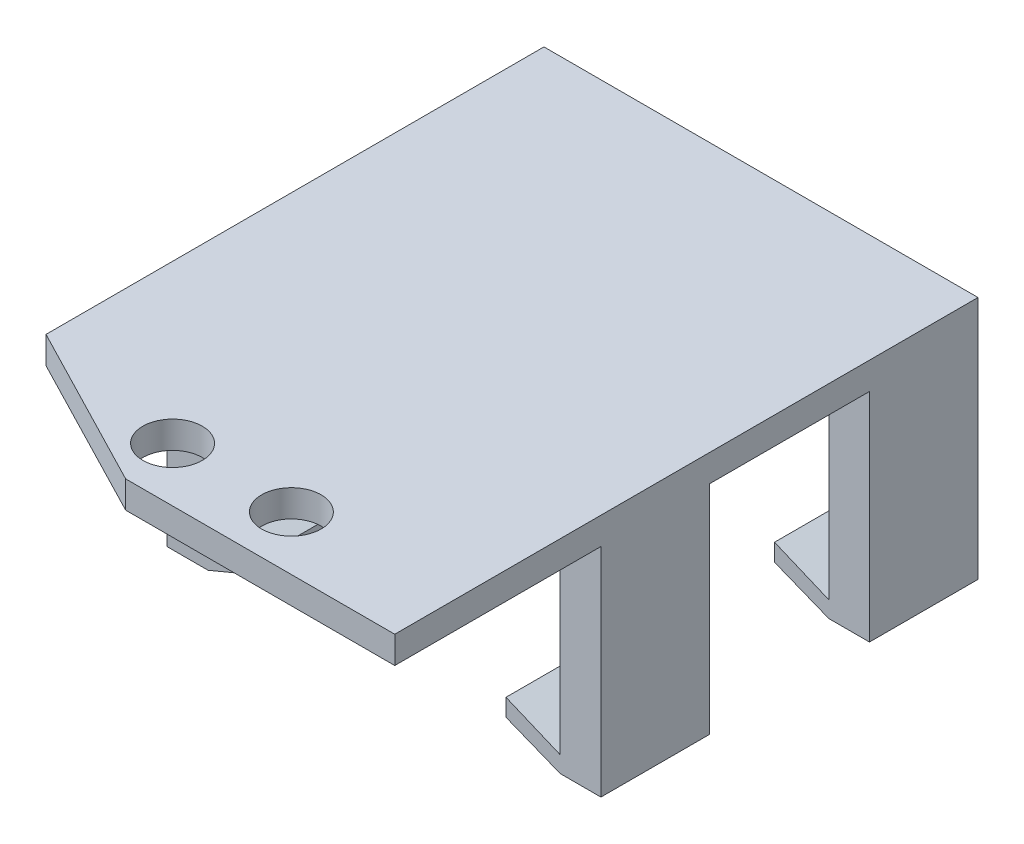
ISO-10303-21;
HEADER;
FILE_DESCRIPTION(('STEP AP214'),'2;1');
FILE_NAME('part.step','',(''),(''),'','','');
FILE_SCHEMA(('AUTOMOTIVE_DESIGN { 1 0 10303 214 1 1 1 1 }'));
ENDSEC;
DATA;
#1=APPLICATION_CONTEXT('core data for automotive mechanical design processes');
#2=APPLICATION_PROTOCOL_DEFINITION('international standard','automotive_design',2000,#1);
#3=PRODUCT_CONTEXT('',#1,'mechanical');
#4=PRODUCT('Part','Part','',(#3));
#5=PRODUCT_RELATED_PRODUCT_CATEGORY('part','',(#4));
#6=PRODUCT_DEFINITION_FORMATION('','',#4);
#7=PRODUCT_DEFINITION_CONTEXT('part definition',#1,'design');
#8=PRODUCT_DEFINITION('design','',#6,#7);
#9=PRODUCT_DEFINITION_SHAPE('','',#8);
#10=(LENGTH_UNIT() NAMED_UNIT(*) SI_UNIT(.MILLI.,.METRE.));
#11=(NAMED_UNIT(*) PLANE_ANGLE_UNIT() SI_UNIT($,.RADIAN.));
#12=(NAMED_UNIT(*) SI_UNIT($,.STERADIAN.) SOLID_ANGLE_UNIT());
#13=UNCERTAINTY_MEASURE_WITH_UNIT(LENGTH_MEASURE(1.E-05),#10,'distance_accuracy_value','');
#14=(GEOMETRIC_REPRESENTATION_CONTEXT(3) GLOBAL_UNCERTAINTY_ASSIGNED_CONTEXT((#13)) GLOBAL_UNIT_ASSIGNED_CONTEXT((#10,
#11,#12)) REPRESENTATION_CONTEXT('',''));
#15=CARTESIAN_POINT('',(0.,0.,0.));
#16=DIRECTION('',(0.,0.,1.));
#17=DIRECTION('',(1.,0.,0.));
#18=AXIS2_PLACEMENT_3D('',#15,#16,#17);
#19=CARTESIAN_POINT('',(0.,-20.32,0.));
#20=DIRECTION('',(0.,-1.,0.));
#21=DIRECTION('',(0.,0.,-1.));
#22=AXIS2_PLACEMENT_3D('',#19,#20,#21);
#23=PLANE('',#22);
#24=DIRECTION('',(1.,0.,0.));
#25=VECTOR('',#24,1.);
#26=CARTESIAN_POINT('',(-11.5172519083969,-20.32,-12.4409837837973));
#27=LINE('',#26,#25);
#28=CARTESIAN_POINT('',(-11.5172519083969,-20.32,-12.4409837837973));
#29=VERTEX_POINT('',#28);
#30=CARTESIAN_POINT('',(-7.66074574714831,-20.32,-12.4409837837973));
#31=VERTEX_POINT('',#30);
#32=EDGE_CURVE('E410',#29,#31,#27,.T.);
#33=ORIENTED_EDGE('',*,*,#32,.T.);
#34=DIRECTION('',(0.,0.,1.));
#35=VECTOR('',#34,1.);
#36=CARTESIAN_POINT('',(-7.66074574714831,-20.32,-12.4409837837973));
#37=LINE('',#36,#35);
#38=CARTESIAN_POINT('',(-7.66074574714831,-20.32,-2.28098378379731));
#39=VERTEX_POINT('',#38);
#40=EDGE_CURVE('E308',#31,#39,#37,.T.);
#41=ORIENTED_EDGE('',*,*,#40,.T.);
#42=DIRECTION('',(1.,0.,0.));
#43=VECTOR('',#42,1.);
#44=CARTESIAN_POINT('',(-11.517251908397,-20.32,-2.28098378379731));
#45=LINE('',#44,#43);
#46=CARTESIAN_POINT('',(-11.517251908397,-20.32,-2.28098378379731));
#47=VERTEX_POINT('',#46);
#48=EDGE_CURVE('E478',#47,#39,#45,.T.);
#49=ORIENTED_EDGE('',*,*,#48,.F.);
#50=DIRECTION('',(0.,0.,-1.));
#51=VECTOR('',#50,1.);
#52=CARTESIAN_POINT('',(-11.5172519083969,-20.32,27.9450162162027));
#53=LINE('',#52,#51);
#54=EDGE_CURVE('E406',#47,#29,#53,.T.);
#55=ORIENTED_EDGE('',*,*,#54,.T.);
#56=EDGE_LOOP('',(#33,#41,#49,#55));
#57=FACE_BOUND('',#56,.T.);
#58=ADVANCED_FACE('F37',(#57),#23,.T.);
#59=CARTESIAN_POINT('',(0.,-20.32,0.));
#60=DIRECTION('',(0.,1.,0.));
#61=DIRECTION('',(0.,0.,1.));
#62=AXIS2_PLACEMENT_3D('',#59,#60,#61);
#63=PLANE('',#62);
#64=DIRECTION('',(0.,0.,1.));
#65=VECTOR('',#64,1.);
#66=CARTESIAN_POINT('',(25.3127480916031,-20.32,-12.4409837837973));
#67=LINE('',#66,#65);
#68=CARTESIAN_POINT('',(25.3127480916031,-20.32,-12.4409837837973));
#69=VERTEX_POINT('',#68);
#70=CARTESIAN_POINT('',(25.3127480916031,-20.32,-2.28098378379732));
#71=VERTEX_POINT('',#70);
#72=EDGE_CURVE('E59',#69,#71,#67,.T.);
#73=ORIENTED_EDGE('',*,*,#72,.F.);
#74=DIRECTION('',(1.,0.,0.));
#75=VECTOR('',#74,1.);
#76=CARTESIAN_POINT('',(29.1227480916031,-20.32,-12.4409837837973));
#77=LINE('',#76,#75);
#78=CARTESIAN_POINT('',(29.1227480916031,-20.32,-12.4409837837973));
#79=VERTEX_POINT('',#78);
#80=EDGE_CURVE('E400',#69,#79,#77,.T.);
#81=ORIENTED_EDGE('',*,*,#80,.T.);
#82=DIRECTION('',(0.,0.,1.));
#83=VECTOR('',#82,1.);
#84=CARTESIAN_POINT('',(29.1227480916031,-20.32,27.9450162162027));
#85=LINE('',#84,#83);
#86=CARTESIAN_POINT('',(29.1227480916031,-20.32,-2.28098378379732));
#87=VERTEX_POINT('',#86);
#88=EDGE_CURVE('E403',#79,#87,#85,.T.);
#89=ORIENTED_EDGE('',*,*,#88,.T.);
#90=EDGE_CURVE('E475',#71,#87,#45,.T.);
#91=ORIENTED_EDGE('',*,*,#90,.F.);
#92=EDGE_LOOP('',(#73,#81,#89,#91));
#93=FACE_BOUND('',#92,.T.);
#94=ADVANCED_FACE('F447',(#93),#63,.F.);
#95=CARTESIAN_POINT('',(20.2327480916031,0.,0.));
#96=DIRECTION('',(-1.,0.,0.));
#97=DIRECTION('',(0.,0.,1.));
#98=AXIS2_PLACEMENT_3D('',#95,#96,#97);
#99=PLANE('',#98);
#100=DIRECTION('',(0.,-1.,0.));
#101=VECTOR('',#100,1.);
#102=CARTESIAN_POINT('',(20.2327480916031,-18.796,-12.4409837837973));
#103=LINE('',#102,#101);
#104=CARTESIAN_POINT('',(20.2327480916031,-16.6688197799885,-12.4409837837973));
#105=VERTEX_POINT('',#104);
#106=CARTESIAN_POINT('',(20.2327480916031,-18.2946026362876,-12.4409837837973));
#107=VERTEX_POINT('',#106);
#108=EDGE_CURVE('E387',#105,#107,#103,.T.);
#109=ORIENTED_EDGE('',*,*,#108,.T.);
#110=DIRECTION('',(0.,0.,1.));
#111=VECTOR('',#110,1.);
#112=CARTESIAN_POINT('',(20.2327480916031,-18.2946026362876,-12.4409837837973));
#113=LINE('',#112,#111);
#114=CARTESIAN_POINT('',(20.2327480916031,-18.2946026362876,-2.28098378379732));
#115=VERTEX_POINT('',#114);
#116=EDGE_CURVE('E560',#107,#115,#113,.T.);
#117=ORIENTED_EDGE('',*,*,#116,.T.);
#118=DIRECTION('',(0.,-1.,0.));
#119=VECTOR('',#118,1.);
#120=CARTESIAN_POINT('',(20.2327480916031,0.,-2.28098378379732));
#121=LINE('',#120,#119);
#122=CARTESIAN_POINT('',(20.2327480916031,-16.6688197799885,-2.28098378379732));
#123=VERTEX_POINT('',#122);
#124=EDGE_CURVE('E313',#123,#115,#121,.T.);
#125=ORIENTED_EDGE('',*,*,#124,.F.);
#126=DIRECTION('',(0.,0.,1.));
#127=VECTOR('',#126,1.);
#128=CARTESIAN_POINT('',(20.2327480916031,-16.6688197799885,-17.9796028196735));
#129=LINE('',#128,#127);
#130=EDGE_CURVE('E337',#105,#123,#129,.T.);
#131=ORIENTED_EDGE('',*,*,#130,.F.);
#132=EDGE_LOOP('',(#109,#117,#125,#131));
#133=FACE_BOUND('',#132,.T.);
#134=ADVANCED_FACE('F454',(#133),#99,.T.);
#135=CARTESIAN_POINT('',(-2.59340745083259,-16.6688197799885,-17.9796028196735));
#136=DIRECTION('',(0.999873452344455,-0.0159084661982284,0.));
#137=DIRECTION('',(0.0159084661982284,0.999873452344455,0.));
#138=AXIS2_PLACEMENT_3D('',#135,#136,#137);
#139=PLANE('',#138);
#140=DIRECTION('',(0.0159084661982284,0.999873452344455,0.));
#141=VECTOR('',#140,1.);
#142=CARTESIAN_POINT('',(-2.59340745083259,-16.6688197799885,-2.28098378379732));
#143=LINE('',#142,#141);
#144=CARTESIAN_POINT('',(-2.61803166417197,-18.2164923774667,-2.28098378379732));
#145=VERTEX_POINT('',#144);
#146=CARTESIAN_POINT('',(-2.59340745083259,-16.6688197799885,-2.28098378379731));
#147=VERTEX_POINT('',#146);
#148=EDGE_CURVE('E331',#145,#147,#143,.T.);
#149=ORIENTED_EDGE('',*,*,#148,.F.);
#150=DIRECTION('',(0.,0.,1.));
#151=VECTOR('',#150,1.);
#152=CARTESIAN_POINT('',(-2.61803166417197,-18.2164923774667,-12.4409837837973));
#153=LINE('',#152,#151);
#154=CARTESIAN_POINT('',(-2.61803166417197,-18.2164923774667,-12.4409837837973));
#155=VERTEX_POINT('',#154);
#156=EDGE_CURVE('E307',#155,#145,#153,.T.);
#157=ORIENTED_EDGE('',*,*,#156,.F.);
#158=DIRECTION('',(-0.0159084661982284,-0.999873452344455,0.));
#159=VECTOR('',#158,1.);
#160=CARTESIAN_POINT('',(-2.59340745083259,-16.6688197799885,-12.4409837837973));
#161=LINE('',#160,#159);
#162=CARTESIAN_POINT('',(-2.59340745083259,-16.6688197799885,-12.4409837837973));
#163=VERTEX_POINT('',#162);
#164=EDGE_CURVE('E345',#163,#155,#161,.T.);
#165=ORIENTED_EDGE('',*,*,#164,.F.);
#166=DIRECTION('',(0.,0.,1.));
#167=VECTOR('',#166,1.);
#168=CARTESIAN_POINT('',(-2.59340745083259,-16.6688197799885,-17.9796028196735));
#169=LINE('',#168,#167);
#170=EDGE_CURVE('E346',#163,#147,#169,.T.);
#171=ORIENTED_EDGE('',*,*,#170,.T.);
#172=EDGE_LOOP('',(#149,#157,#165,#171));
#173=FACE_BOUND('',#172,.T.);
#174=ADVANCED_FACE('F460',(#173),#139,.T.);
#175=DIRECTION('',(1.,0.,0.));
#176=VECTOR('',#175,1.);
#177=CARTESIAN_POINT('',(-11.517251908397,-20.32,12.7050162162027));
#178=LINE('',#177,#176);
#179=CARTESIAN_POINT('',(-11.517251908397,-20.32,12.7050162162027));
#180=VERTEX_POINT('',#179);
#181=CARTESIAN_POINT('',(-7.66074574714831,-20.32,12.7050162162027));
#182=VERTEX_POINT('',#181);
#183=EDGE_CURVE('E470',#180,#182,#178,.T.);
#184=ORIENTED_EDGE('',*,*,#183,.T.);
#185=CARTESIAN_POINT('',(-7.66074574714831,-20.32,22.8650162162027));
#186=VERTEX_POINT('',#185);
#187=EDGE_CURVE('E295',#182,#186,#37,.T.);
#188=ORIENTED_EDGE('',*,*,#187,.T.);
#189=DIRECTION('',(1.,0.,0.));
#190=VECTOR('',#189,1.);
#191=CARTESIAN_POINT('',(-11.5172519083969,-20.32,22.8650162162027));
#192=LINE('',#191,#190);
#193=CARTESIAN_POINT('',(-11.5172519083969,-20.32,22.8650162162027));
#194=VERTEX_POINT('',#193);
#195=EDGE_CURVE('E373',#194,#186,#192,.T.);
#196=ORIENTED_EDGE('',*,*,#195,.F.);
#197=EDGE_CURVE('E407',#194,#180,#53,.T.);
#198=ORIENTED_EDGE('',*,*,#197,.T.);
#199=EDGE_LOOP('',(#184,#188,#196,#198));
#200=FACE_BOUND('',#199,.T.);
#201=ADVANCED_FACE('F450',(#200),#23,.T.);
#202=CARTESIAN_POINT('',(25.3127480916031,-20.32,12.7050162162027));
#203=VERTEX_POINT('',#202);
#204=CARTESIAN_POINT('',(25.3127480916031,-20.32,22.8650162162027));
#205=VERTEX_POINT('',#204);
#206=EDGE_CURVE('E594',#203,#205,#67,.T.);
#207=ORIENTED_EDGE('',*,*,#206,.F.);
#208=CARTESIAN_POINT('',(29.1227480916031,-20.32,12.7050162162027));
#209=VERTEX_POINT('',#208);
#210=EDGE_CURVE('E476',#203,#209,#178,.T.);
#211=ORIENTED_EDGE('',*,*,#210,.T.);
#212=CARTESIAN_POINT('',(29.1227480916031,-20.32,22.8650162162027));
#213=VERTEX_POINT('',#212);
#214=EDGE_CURVE('E402',#209,#213,#85,.T.);
#215=ORIENTED_EDGE('',*,*,#214,.T.);
#216=EDGE_CURVE('E372',#205,#213,#192,.T.);
#217=ORIENTED_EDGE('',*,*,#216,.F.);
#218=EDGE_LOOP('',(#207,#211,#215,#217));
#219=FACE_BOUND('',#218,.T.);
#220=ADVANCED_FACE('F457',(#219),#63,.F.);
#221=DIRECTION('',(0.,1.,0.));
#222=VECTOR('',#221,1.);
#223=CARTESIAN_POINT('',(20.2327480916031,0.,12.7050162162027));
#224=LINE('',#223,#222);
#225=CARTESIAN_POINT('',(20.2327480916031,-18.2946026362876,12.7050162162027));
#226=VERTEX_POINT('',#225);
#227=CARTESIAN_POINT('',(20.2327480916031,-16.6688197799885,12.7050162162027));
#228=VERTEX_POINT('',#227);
#229=EDGE_CURVE('E487',#226,#228,#224,.T.);
#230=ORIENTED_EDGE('',*,*,#229,.F.);
#231=CARTESIAN_POINT('',(20.2327480916031,-18.2946026362876,22.8650162162027));
#232=VERTEX_POINT('',#231);
#233=EDGE_CURVE('E595',#226,#232,#113,.T.);
#234=ORIENTED_EDGE('',*,*,#233,.T.);
#235=DIRECTION('',(0.,1.,0.));
#236=VECTOR('',#235,1.);
#237=CARTESIAN_POINT('',(20.2327480916031,0.,22.8650162162027));
#238=LINE('',#237,#236);
#239=CARTESIAN_POINT('',(20.2327480916031,-16.6688197799885,22.8650162162027));
#240=VERTEX_POINT('',#239);
#241=EDGE_CURVE('E281',#232,#240,#238,.T.);
#242=ORIENTED_EDGE('',*,*,#241,.T.);
#243=EDGE_CURVE('E336',#228,#240,#129,.T.);
#244=ORIENTED_EDGE('',*,*,#243,.F.);
#245=EDGE_LOOP('',(#230,#234,#242,#244));
#246=FACE_BOUND('',#245,.T.);
#247=ADVANCED_FACE('F466',(#246),#99,.T.);
#248=CARTESIAN_POINT('',(-11.5172519083969,2.54,-12.4409837837973));
#249=DIRECTION('',(0.,0.,1.));
#250=DIRECTION('',(1.,0.,0.));
#251=AXIS2_PLACEMENT_3D('',#248,#249,#250);
#252=PLANE('',#251);
#253=DIRECTION('',(0.922922412237394,0.384986001031089,0.));
#254=VECTOR('',#253,1.);
#255=CARTESIAN_POINT('',(6.08451261866922,-14.5863305373994,-12.4409837837973));
#256=LINE('',#255,#254);
#257=EDGE_CURVE('E542',#31,#155,#256,.T.);
#258=ORIENTED_EDGE('',*,*,#257,.F.);
#259=ORIENTED_EDGE('',*,*,#32,.F.);
#260=DIRECTION('',(0.,-1.,0.));
#261=VECTOR('',#260,1.);
#262=CARTESIAN_POINT('',(-11.5172519083969,2.54,-12.4409837837973));
#263=LINE('',#262,#261);
#264=CARTESIAN_POINT('',(-11.5172519083969,2.54,-12.4409837837973));
#265=VERTEX_POINT('',#264);
#266=EDGE_CURVE('E266',#265,#29,#263,.T.);
#267=ORIENTED_EDGE('',*,*,#266,.F.);
#268=DIRECTION('',(-1.,0.,0.));
#269=VECTOR('',#268,1.);
#270=CARTESIAN_POINT('',(-11.5172519083969,2.54,-12.4409837837973));
#271=LINE('',#270,#269);
#272=CARTESIAN_POINT('',(29.1227480916031,2.54,-12.4409837837973));
#273=VERTEX_POINT('',#272);
#274=EDGE_CURVE('E259',#273,#265,#271,.T.);
#275=ORIENTED_EDGE('',*,*,#274,.F.);
#276=DIRECTION('',(0.,-1.,0.));
#277=VECTOR('',#276,1.);
#278=CARTESIAN_POINT('',(29.1227480916031,2.54,-12.4409837837973));
#279=LINE('',#278,#277);
#280=EDGE_CURVE('E277',#273,#79,#279,.T.);
#281=ORIENTED_EDGE('',*,*,#280,.T.);
#282=ORIENTED_EDGE('',*,*,#80,.F.);
#283=DIRECTION('',(0.928892421611158,-0.370349657855058,0.));
#284=VECTOR('',#283,1.);
#285=CARTESIAN_POINT('',(-3.51851670614279,-8.82496698546269,-12.4409837837973));
#286=LINE('',#285,#284);
#287=EDGE_CURVE('E601',#107,#69,#286,.T.);
#288=ORIENTED_EDGE('',*,*,#287,.F.);
#289=ORIENTED_EDGE('',*,*,#108,.F.);
#290=DIRECTION('',(0.922397741391246,-0.386241383950928,0.));
#291=VECTOR('',#290,1.);
#292=CARTESIAN_POINT('',(20.2327480916031,-16.6688197799885,-12.4409837837973));
#293=LINE('',#292,#291);
#294=CARTESIAN_POINT('',(25.3127480916031,-18.796,-12.4409837837973));
#295=VERTEX_POINT('',#294);
#296=EDGE_CURVE('E333',#105,#295,#293,.T.);
#297=ORIENTED_EDGE('',*,*,#296,.T.);
#298=DIRECTION('',(0.,1.,0.));
#299=VECTOR('',#298,1.);
#300=CARTESIAN_POINT('',(25.3127480916031,-20.32,-12.4409837837973));
#301=LINE('',#300,#299);
#302=CARTESIAN_POINT('',(25.3127480916031,-2.9718,-12.4409837837973));
#303=VERTEX_POINT('',#302);
#304=EDGE_CURVE('E397',#295,#303,#301,.T.);
#305=ORIENTED_EDGE('',*,*,#304,.T.);
#306=DIRECTION('',(1.,0.,0.));
#307=VECTOR('',#306,1.);
#308=CARTESIAN_POINT('',(-11.5172519083969,-2.9718,-12.4409837837973));
#309=LINE('',#308,#307);
#310=CARTESIAN_POINT('',(-7.70725190839694,-2.9718,-12.4409837837973));
#311=VERTEX_POINT('',#310);
#312=EDGE_CURVE('E356',#311,#303,#309,.T.);
#313=ORIENTED_EDGE('',*,*,#312,.F.);
#314=DIRECTION('',(0.,1.,0.));
#315=VECTOR('',#314,1.);
#316=CARTESIAN_POINT('',(-7.70725190839694,-20.32,-12.4409837837973));
#317=LINE('',#316,#315);
#318=CARTESIAN_POINT('',(-7.70725190839694,-18.796,-12.4409837837973));
#319=VERTEX_POINT('',#318);
#320=EDGE_CURVE('E413',#319,#311,#317,.T.);
#321=ORIENTED_EDGE('',*,*,#320,.F.);
#322=DIRECTION('',(0.923306770954936,0.384063284770582,0.));
#323=VECTOR('',#322,1.);
#324=CARTESIAN_POINT('',(-7.70725190839694,-18.796,-12.4409837837973));
#325=LINE('',#324,#323);
#326=EDGE_CURVE('E343',#319,#163,#325,.T.);
#327=ORIENTED_EDGE('',*,*,#326,.T.);
#328=ORIENTED_EDGE('',*,*,#164,.T.);
#329=EDGE_LOOP('',(#258,#259,#267,#275,#281,#282,#288,#289,#297,#305,#313,#321,#327,#328));
#330=FACE_BOUND('',#329,.T.);
#331=ADVANCED_FACE('F540',(#330),#252,.F.);
#332=CARTESIAN_POINT('',(0.,0.,22.8650162162027));
#333=DIRECTION('',(0.,0.,1.));
#334=DIRECTION('',(1.,0.,0.));
#335=AXIS2_PLACEMENT_3D('',#332,#333,#334);
#336=PLANE('',#335);
#337=ORIENTED_EDGE('',*,*,#195,.T.);
#338=DIRECTION('',(0.922922412237394,0.384986001031089,0.));
#339=VECTOR('',#338,1.);
#340=CARTESIAN_POINT('',(6.08451261866922,-14.5863305373994,22.8650162162027));
#341=LINE('',#340,#339);
#342=CARTESIAN_POINT('',(-2.61803166417197,-18.2164923774667,22.8650162162027));
#343=VERTEX_POINT('',#342);
#344=EDGE_CURVE('E597',#186,#343,#341,.T.);
#345=ORIENTED_EDGE('',*,*,#344,.T.);
#346=DIRECTION('',(0.0159084661982284,0.999873452344455,0.));
#347=VECTOR('',#346,1.);
#348=CARTESIAN_POINT('',(-2.59340745083259,-16.6688197799885,22.8650162162027));
#349=LINE('',#348,#347);
#350=CARTESIAN_POINT('',(-2.59340745083259,-16.6688197799885,22.8650162162027));
#351=VERTEX_POINT('',#350);
#352=EDGE_CURVE('E306',#343,#351,#349,.T.);
#353=ORIENTED_EDGE('',*,*,#352,.T.);
#354=DIRECTION('',(-0.923306770954936,-0.384063284770582,0.));
#355=VECTOR('',#354,1.);
#356=CARTESIAN_POINT('',(-7.70725190839694,-18.796,22.8650162162027));
#357=LINE('',#356,#355);
#358=CARTESIAN_POINT('',(-7.70725190839694,-18.796,22.8650162162027));
#359=VERTEX_POINT('',#358);
#360=EDGE_CURVE('E348',#351,#359,#357,.T.);
#361=ORIENTED_EDGE('',*,*,#360,.T.);
#362=DIRECTION('',(0.,1.,0.));
#363=VECTOR('',#362,1.);
#364=CARTESIAN_POINT('',(-7.70725190839694,-20.32,22.8650162162027));
#365=LINE('',#364,#363);
#366=CARTESIAN_POINT('',(-7.70725190839694,-2.9718,22.8650162162027));
#367=VERTEX_POINT('',#366);
#368=EDGE_CURVE('E383',#359,#367,#365,.T.);
#369=ORIENTED_EDGE('',*,*,#368,.T.);
#370=DIRECTION('',(-1.,0.,0.));
#371=VECTOR('',#370,1.);
#372=CARTESIAN_POINT('',(-11.5172519083969,-2.9718,22.8650162162027));
#373=LINE('',#372,#371);
#374=CARTESIAN_POINT('',(25.3127480916031,-2.9718,22.8650162162027));
#375=VERTEX_POINT('',#374);
#376=EDGE_CURVE('E359',#375,#367,#373,.T.);
#377=ORIENTED_EDGE('',*,*,#376,.F.);
#378=DIRECTION('',(0.,-1.,0.));
#379=VECTOR('',#378,1.);
#380=CARTESIAN_POINT('',(25.3127480916031,-20.32,22.8650162162027));
#381=LINE('',#380,#379);
#382=CARTESIAN_POINT('',(25.3127480916031,-18.796,22.8650162162027));
#383=VERTEX_POINT('',#382);
#384=EDGE_CURVE('E380',#375,#383,#381,.T.);
#385=ORIENTED_EDGE('',*,*,#384,.T.);
#386=DIRECTION('',(-0.922397741391246,0.386241383950928,0.));
#387=VECTOR('',#386,1.);
#388=CARTESIAN_POINT('',(20.2327480916031,-16.6688197799885,22.8650162162027));
#389=LINE('',#388,#387);
#390=EDGE_CURVE('E340',#383,#240,#389,.T.);
#391=ORIENTED_EDGE('',*,*,#390,.T.);
#392=ORIENTED_EDGE('',*,*,#241,.F.);
#393=DIRECTION('',(0.928892421611158,-0.370349657855058,0.));
#394=VECTOR('',#393,1.);
#395=CARTESIAN_POINT('',(-3.51851670614279,-8.82496698546269,22.8650162162027));
#396=LINE('',#395,#394);
#397=EDGE_CURVE('E598',#232,#205,#396,.T.);
#398=ORIENTED_EDGE('',*,*,#397,.T.);
#399=ORIENTED_EDGE('',*,*,#216,.T.);
#400=DIRECTION('',(0.,1.,0.));
#401=VECTOR('',#400,1.);
#402=CARTESIAN_POINT('',(29.1227480916031,0.,22.8650162162027));
#403=LINE('',#402,#401);
#404=CARTESIAN_POINT('',(29.1227480916031,0.,22.8650162162027));
#405=VERTEX_POINT('',#404);
#406=EDGE_CURVE('E376',#213,#405,#403,.T.);
#407=ORIENTED_EDGE('',*,*,#406,.T.);
#408=DIRECTION('',(-1.,0.,0.));
#409=VECTOR('',#408,1.);
#410=CARTESIAN_POINT('',(-11.5172519083969,0.,22.8650162162027));
#411=LINE('',#410,#409);
#412=CARTESIAN_POINT('',(-11.5172519083969,0.,22.8650162162027));
#413=VERTEX_POINT('',#412);
#414=EDGE_CURVE('E378',#405,#413,#411,.T.);
#415=ORIENTED_EDGE('',*,*,#414,.T.);
#416=DIRECTION('',(0.,-1.,0.));
#417=VECTOR('',#416,1.);
#418=CARTESIAN_POINT('',(-11.5172519083969,0.,22.8650162162027));
#419=LINE('',#418,#417);
#420=EDGE_CURVE('E370',#413,#194,#419,.T.);
#421=ORIENTED_EDGE('',*,*,#420,.T.);
#422=EDGE_LOOP('',(#337,#345,#353,#361,#369,#377,#385,#391,#392,#398,#399,#407,#415,#421));
#423=FACE_BOUND('',#422,.T.);
#424=ADVANCED_FACE('F504',(#423),#336,.T.);
#425=ORIENTED_EDGE('',*,*,#352,.F.);
#426=CARTESIAN_POINT('',(-2.61803166417197,-18.2164923774667,12.7050162162027));
#427=VERTEX_POINT('',#426);
#428=EDGE_CURVE('E292',#427,#343,#153,.T.);
#429=ORIENTED_EDGE('',*,*,#428,.F.);
#430=DIRECTION('',(-0.0159084661982284,-0.999873452344455,0.));
#431=VECTOR('',#430,1.);
#432=CARTESIAN_POINT('',(-2.59340745083259,-16.6688197799885,12.7050162162027));
#433=LINE('',#432,#431);
#434=CARTESIAN_POINT('',(-2.59340745083259,-16.6688197799885,12.7050162162027));
#435=VERTEX_POINT('',#434);
#436=EDGE_CURVE('E304',#435,#427,#433,.T.);
#437=ORIENTED_EDGE('',*,*,#436,.F.);
#438=EDGE_CURVE('E351',#435,#351,#169,.T.);
#439=ORIENTED_EDGE('',*,*,#438,.T.);
#440=EDGE_LOOP('',(#425,#429,#437,#439));
#441=FACE_BOUND('',#440,.T.);
#442=ADVANCED_FACE('F302',(#441),#139,.T.);
#443=CARTESIAN_POINT('',(-11.517251908397,-20.32,-2.28098378379731));
#444=DIRECTION('',(0.,0.,-1.));
#445=DIRECTION('',(-1.,0.,0.));
#446=AXIS2_PLACEMENT_3D('',#443,#444,#445);
#447=PLANE('',#446);
#448=DIRECTION('',(-0.922922412237394,-0.384986001031089,0.));
#449=VECTOR('',#448,1.);
#450=CARTESIAN_POINT('',(-10.9456628519647,-21.6902637222083,-2.28098378379731));
#451=LINE('',#450,#449);
#452=EDGE_CURVE('E565',#145,#39,#451,.T.);
#453=ORIENTED_EDGE('',*,*,#452,.F.);
#454=ORIENTED_EDGE('',*,*,#148,.T.);
#455=DIRECTION('',(-0.923306770954936,-0.384063284770582,0.));
#456=VECTOR('',#455,1.);
#457=CARTESIAN_POINT('',(-7.70725190839694,-18.796,-2.28098378379731));
#458=LINE('',#457,#456);
#459=CARTESIAN_POINT('',(-7.70725190839694,-18.796,-2.28098378379731));
#460=VERTEX_POINT('',#459);
#461=EDGE_CURVE('E329',#147,#460,#458,.T.);
#462=ORIENTED_EDGE('',*,*,#461,.T.);
#463=DIRECTION('',(0.,-1.,0.));
#464=VECTOR('',#463,1.);
#465=CARTESIAN_POINT('',(-7.70725190839694,-20.32,-2.28098378379731));
#466=LINE('',#465,#464);
#467=CARTESIAN_POINT('',(-7.70725190839694,-2.9718,-2.28098378379732));
#468=VERTEX_POINT('',#467);
#469=EDGE_CURVE('E326',#468,#460,#466,.T.);
#470=ORIENTED_EDGE('',*,*,#469,.F.);
#471=DIRECTION('',(1.,0.,0.));
#472=VECTOR('',#471,1.);
#473=CARTESIAN_POINT('',(0.,-2.9718,-2.28098378379732));
#474=LINE('',#473,#472);
#475=CARTESIAN_POINT('',(25.3127480916031,-2.9718,-2.28098378379732));
#476=VERTEX_POINT('',#475);
#477=EDGE_CURVE('E324',#468,#476,#474,.T.);
#478=ORIENTED_EDGE('',*,*,#477,.T.);
#479=DIRECTION('',(0.,1.,0.));
#480=VECTOR('',#479,1.);
#481=CARTESIAN_POINT('',(25.3127480916031,-20.32,-2.28098378379732));
#482=LINE('',#481,#480);
#483=CARTESIAN_POINT('',(25.3127480916031,-18.796,-2.28098378379732));
#484=VERTEX_POINT('',#483);
#485=EDGE_CURVE('E316',#484,#476,#482,.T.);
#486=ORIENTED_EDGE('',*,*,#485,.F.);
#487=DIRECTION('',(-0.922397741391246,0.386241383950928,0.));
#488=VECTOR('',#487,1.);
#489=CARTESIAN_POINT('',(20.2327480916031,-16.6688197799885,-2.28098378379732));
#490=LINE('',#489,#488);
#491=EDGE_CURVE('E285',#484,#123,#490,.T.);
#492=ORIENTED_EDGE('',*,*,#491,.T.);
#493=ORIENTED_EDGE('',*,*,#124,.T.);
#494=DIRECTION('',(-0.928892421611158,0.370349657855058,0.));
#495=VECTOR('',#494,1.);
#496=CARTESIAN_POINT('',(-6.46569076042514,-7.64992789885931,-2.28098378379732));
#497=LINE('',#496,#495);
#498=EDGE_CURVE('E561',#71,#115,#497,.T.);
#499=ORIENTED_EDGE('',*,*,#498,.F.);
#500=ORIENTED_EDGE('',*,*,#90,.T.);
#501=DIRECTION('',(0.,1.,0.));
#502=VECTOR('',#501,1.);
#503=CARTESIAN_POINT('',(29.1227480916031,-20.32,-2.28098378379732));
#504=LINE('',#503,#502);
#505=CARTESIAN_POINT('',(29.1227480916031,0.,-2.28098378379732));
#506=VERTEX_POINT('',#505);
#507=EDGE_CURVE('E572',#87,#506,#504,.T.);
#508=ORIENTED_EDGE('',*,*,#507,.T.);
#509=DIRECTION('',(1.,0.,0.));
#510=VECTOR('',#509,1.);
#511=CARTESIAN_POINT('',(-11.517251908397,0.,-2.28098378379732));
#512=LINE('',#511,#510);
#513=CARTESIAN_POINT('',(-11.517251908397,0.,-2.28098378379732));
#514=VERTEX_POINT('',#513);
#515=EDGE_CURVE('E484',#514,#506,#512,.T.);
#516=ORIENTED_EDGE('',*,*,#515,.F.);
#517=DIRECTION('',(0.,1.,0.));
#518=VECTOR('',#517,1.);
#519=CARTESIAN_POINT('',(-11.517251908397,-20.32,-2.28098378379731));
#520=LINE('',#519,#518);
#521=EDGE_CURVE('E583',#47,#514,#520,.T.);
#522=ORIENTED_EDGE('',*,*,#521,.F.);
#523=ORIENTED_EDGE('',*,*,#48,.T.);
#524=EDGE_LOOP('',(#453,#454,#462,#470,#478,#486,#492,#493,#499,#500,#508,#516,#522,#523));
#525=FACE_BOUND('',#524,.T.);
#526=ADVANCED_FACE('F548',(#525),#447,.F.);
#527=CARTESIAN_POINT('',(-11.517251908397,-20.32,12.7050162162027));
#528=DIRECTION('',(0.,0.,1.));
#529=DIRECTION('',(0.,-1.,0.));
#530=AXIS2_PLACEMENT_3D('',#527,#528,#529);
#531=PLANE('',#530);
#532=DIRECTION('',(0.922922412237394,0.384986001031089,0.));
#533=VECTOR('',#532,1.);
#534=CARTESIAN_POINT('',(-10.9456628519647,-21.6902637222083,12.7050162162027));
#535=LINE('',#534,#533);
#536=EDGE_CURVE('E45',#182,#427,#535,.T.);
#537=ORIENTED_EDGE('',*,*,#536,.F.);
#538=ORIENTED_EDGE('',*,*,#183,.F.);
#539=DIRECTION('',(0.,-1.,0.));
#540=VECTOR('',#539,1.);
#541=CARTESIAN_POINT('',(-11.517251908397,-20.32,12.7050162162027));
#542=LINE('',#541,#540);
#543=CARTESIAN_POINT('',(-11.517251908397,0.,12.7050162162027));
#544=VERTEX_POINT('',#543);
#545=EDGE_CURVE('E486',#544,#180,#542,.T.);
#546=ORIENTED_EDGE('',*,*,#545,.F.);
#547=DIRECTION('',(1.,0.,0.));
#548=VECTOR('',#547,1.);
#549=CARTESIAN_POINT('',(-11.517251908397,0.,12.7050162162027));
#550=LINE('',#549,#548);
#551=CARTESIAN_POINT('',(29.1227480916031,0.,12.7050162162027));
#552=VERTEX_POINT('',#551);
#553=EDGE_CURVE('E480',#544,#552,#550,.T.);
#554=ORIENTED_EDGE('',*,*,#553,.T.);
#555=DIRECTION('',(0.,-1.,0.));
#556=VECTOR('',#555,1.);
#557=CARTESIAN_POINT('',(29.1227480916031,-20.32,12.7050162162027));
#558=LINE('',#557,#556);
#559=EDGE_CURVE('E577',#552,#209,#558,.T.);
#560=ORIENTED_EDGE('',*,*,#559,.T.);
#561=ORIENTED_EDGE('',*,*,#210,.F.);
#562=DIRECTION('',(0.928892421611158,-0.370349657855058,0.));
#563=VECTOR('',#562,1.);
#564=CARTESIAN_POINT('',(-6.46569076042514,-7.64992789885931,12.7050162162027));
#565=LINE('',#564,#563);
#566=EDGE_CURVE('E287',#226,#203,#565,.T.);
#567=ORIENTED_EDGE('',*,*,#566,.F.);
#568=ORIENTED_EDGE('',*,*,#229,.T.);
#569=DIRECTION('',(0.922397741391246,-0.386241383950928,0.));
#570=VECTOR('',#569,1.);
#571=CARTESIAN_POINT('',(20.2327480916031,-16.6688197799885,12.7050162162027));
#572=LINE('',#571,#570);
#573=CARTESIAN_POINT('',(25.3127480916031,-18.796,12.7050162162027));
#574=VERTEX_POINT('',#573);
#575=EDGE_CURVE('E283',#228,#574,#572,.T.);
#576=ORIENTED_EDGE('',*,*,#575,.T.);
#577=DIRECTION('',(0.,-1.,0.));
#578=VECTOR('',#577,1.);
#579=CARTESIAN_POINT('',(25.3127480916031,-20.32,12.7050162162027));
#580=LINE('',#579,#578);
#581=CARTESIAN_POINT('',(25.3127480916031,-2.9718,12.7050162162027));
#582=VERTEX_POINT('',#581);
#583=EDGE_CURVE('E489',#582,#574,#580,.T.);
#584=ORIENTED_EDGE('',*,*,#583,.F.);
#585=DIRECTION('',(-1.,0.,0.));
#586=VECTOR('',#585,1.);
#587=CARTESIAN_POINT('',(0.,-2.9718,12.7050162162027));
#588=LINE('',#587,#586);
#589=CARTESIAN_POINT('',(-7.70725190839694,-2.9718,12.7050162162027));
#590=VERTEX_POINT('',#589);
#591=EDGE_CURVE('E492',#582,#590,#588,.T.);
#592=ORIENTED_EDGE('',*,*,#591,.T.);
#593=DIRECTION('',(0.,1.,0.));
#594=VECTOR('',#593,1.);
#595=CARTESIAN_POINT('',(-7.70725190839694,-20.32,12.7050162162027));
#596=LINE('',#595,#594);
#597=CARTESIAN_POINT('',(-7.70725190839694,-18.796,12.7050162162027));
#598=VERTEX_POINT('',#597);
#599=EDGE_CURVE('E318',#598,#590,#596,.T.);
#600=ORIENTED_EDGE('',*,*,#599,.F.);
#601=DIRECTION('',(0.923306770954936,0.384063284770582,0.));
#602=VECTOR('',#601,1.);
#603=CARTESIAN_POINT('',(-7.70725190839694,-18.796,12.7050162162027));
#604=LINE('',#603,#602);
#605=EDGE_CURVE('E312',#598,#435,#604,.T.);
#606=ORIENTED_EDGE('',*,*,#605,.T.);
#607=ORIENTED_EDGE('',*,*,#436,.T.);
#608=EDGE_LOOP('',(#537,#538,#546,#554,#560,#561,#567,#568,#576,#584,#592,#600,#606,#607));
#609=FACE_BOUND('',#608,.T.);
#610=ADVANCED_FACE('F310',(#609),#531,.F.);
#611=CARTESIAN_POINT('',(25.3127480916031,-20.32,27.9450162162027));
#612=DIRECTION('',(1.,0.,0.));
#613=DIRECTION('',(0.,0.,-1.));
#614=AXIS2_PLACEMENT_3D('',#611,#612,#613);
#615=PLANE('',#614);
#616=DIRECTION('',(0.,0.,-1.));
#617=VECTOR('',#616,1.);
#618=CARTESIAN_POINT('',(25.3127480916031,-18.796,-12.4409837837973));
#619=LINE('',#618,#617);
#620=EDGE_CURVE('E386',#484,#295,#619,.T.);
#621=ORIENTED_EDGE('',*,*,#620,.F.);
#622=ORIENTED_EDGE('',*,*,#485,.T.);
#623=DIRECTION('',(0.,0.,-1.));
#624=VECTOR('',#623,1.);
#625=CARTESIAN_POINT('',(25.3127480916031,-2.9718,27.9450162162027));
#626=LINE('',#625,#624);
#627=EDGE_CURVE('E366',#476,#303,#626,.T.);
#628=ORIENTED_EDGE('',*,*,#627,.T.);
#629=ORIENTED_EDGE('',*,*,#304,.F.);
#630=EDGE_LOOP('',(#621,#622,#628,#629));
#631=FACE_BOUND('',#630,.T.);
#632=ADVANCED_FACE('F553',(#631),#615,.F.);
#633=CARTESIAN_POINT('',(-7.70725190839694,-20.32,27.9450162162027));
#634=DIRECTION('',(-1.,0.,0.));
#635=DIRECTION('',(0.,0.,1.));
#636=AXIS2_PLACEMENT_3D('',#633,#634,#635);
#637=PLANE('',#636);
#638=DIRECTION('',(0.,0.,1.));
#639=VECTOR('',#638,1.);
#640=CARTESIAN_POINT('',(-7.70725190839694,-2.9718,27.9450162162027));
#641=LINE('',#640,#639);
#642=EDGE_CURVE('E363',#311,#468,#641,.T.);
#643=ORIENTED_EDGE('',*,*,#642,.T.);
#644=ORIENTED_EDGE('',*,*,#469,.T.);
#645=DIRECTION('',(0.,0.,1.));
#646=VECTOR('',#645,1.);
#647=CARTESIAN_POINT('',(-7.70725190839694,-18.796,27.9450162162027));
#648=LINE('',#647,#646);
#649=EDGE_CURVE('E394',#319,#460,#648,.T.);
#650=ORIENTED_EDGE('',*,*,#649,.F.);
#651=ORIENTED_EDGE('',*,*,#320,.T.);
#652=EDGE_LOOP('',(#643,#644,#650,#651));
#653=FACE_BOUND('',#652,.T.);
#654=ADVANCED_FACE('F529',(#653),#637,.F.);
#655=CARTESIAN_POINT('',(0.,-2.9718,0.));
#656=DIRECTION('',(0.,-1.,0.));
#657=DIRECTION('',(0.,0.,-1.));
#658=AXIS2_PLACEMENT_3D('',#655,#656,#657);
#659=PLANE('',#658);
#660=ORIENTED_EDGE('',*,*,#477,.F.);
#661=ORIENTED_EDGE('',*,*,#642,.F.);
#662=ORIENTED_EDGE('',*,*,#312,.T.);
#663=ORIENTED_EDGE('',*,*,#627,.F.);
#664=EDGE_LOOP('',(#660,#661,#662,#663));
#665=FACE_BOUND('',#664,.T.);
#666=ADVANCED_FACE('F521',(#665),#659,.T.);
#667=CARTESIAN_POINT('',(-7.70725190839694,-18.796,-17.9796028196735));
#668=DIRECTION('',(-0.384063284770582,0.923306770954936,0.));
#669=DIRECTION('',(-0.923306770954936,-0.384063284770582,0.));
#670=AXIS2_PLACEMENT_3D('',#667,#668,#669);
#671=PLANE('',#670);
#672=ORIENTED_EDGE('',*,*,#461,.F.);
#673=ORIENTED_EDGE('',*,*,#170,.F.);
#674=ORIENTED_EDGE('',*,*,#326,.F.);
#675=ORIENTED_EDGE('',*,*,#649,.T.);
#676=EDGE_LOOP('',(#672,#673,#674,#675));
#677=FACE_BOUND('',#676,.T.);
#678=ADVANCED_FACE('F511',(#677),#671,.T.);
#679=CARTESIAN_POINT('',(20.2327480916031,-16.6688197799885,-17.9796028196735));
#680=DIRECTION('',(0.386241383950928,0.922397741391246,0.));
#681=DIRECTION('',(-0.922397741391246,0.386241383950928,0.));
#682=AXIS2_PLACEMENT_3D('',#679,#680,#681);
#683=PLANE('',#682);
#684=ORIENTED_EDGE('',*,*,#491,.F.);
#685=ORIENTED_EDGE('',*,*,#620,.T.);
#686=ORIENTED_EDGE('',*,*,#296,.F.);
#687=ORIENTED_EDGE('',*,*,#130,.T.);
#688=EDGE_LOOP('',(#684,#685,#686,#687));
#689=FACE_BOUND('',#688,.T.);
#690=ADVANCED_FACE('F519',(#689),#683,.T.);
#691=CARTESIAN_POINT('',(0.,0.,0.));
#692=DIRECTION('',(0.,1.,0.));
#693=DIRECTION('',(0.,0.,1.));
#694=AXIS2_PLACEMENT_3D('',#691,#692,#693);
#695=PLANE('',#694);
#696=DIRECTION('',(1.,0.,0.));
#697=VECTOR('',#696,1.);
#698=CARTESIAN_POINT('',(18.8852561135843,0.,42.1690162162027));
#699=LINE('',#698,#697);
#700=CARTESIAN_POINT('',(3.92724006962182,0.,42.1690162162027));
#701=VERTEX_POINT('',#700);
#702=CARTESIAN_POINT('',(29.1227480916031,0.,42.1690162162027));
#703=VERTEX_POINT('',#702);
#704=EDGE_CURVE('E270',#701,#703,#699,.T.);
#705=ORIENTED_EDGE('',*,*,#704,.F.);
#706=DIRECTION('',(-0.888278607187186,0.,-0.459305035911423));
#707=VECTOR('',#706,1.);
#708=CARTESIAN_POINT('',(-16.3760772977566,0.,31.6707155286802));
#709=LINE('',#708,#707);
#710=CARTESIAN_POINT('',(-11.5172519083969,0.,34.1830837787881));
#711=VERTEX_POINT('',#710);
#712=EDGE_CURVE('E52',#701,#711,#709,.T.);
#713=ORIENTED_EDGE('',*,*,#712,.T.);
#714=DIRECTION('',(0.,0.,1.));
#715=VECTOR('',#714,1.);
#716=CARTESIAN_POINT('',(-11.5172519083969,0.,-12.4409837837973));
#717=LINE('',#716,#715);
#718=EDGE_CURVE('E267',#413,#711,#717,.T.);
#719=ORIENTED_EDGE('',*,*,#718,.F.);
#720=ORIENTED_EDGE('',*,*,#414,.F.);
#721=DIRECTION('',(0.,0.,-1.));
#722=VECTOR('',#721,1.);
#723=CARTESIAN_POINT('',(29.1227480916031,0.,-12.4409837837973));
#724=LINE('',#723,#722);
#725=EDGE_CURVE('E261',#703,#405,#724,.T.);
#726=ORIENTED_EDGE('',*,*,#725,.F.);
#727=EDGE_LOOP('',(#705,#713,#719,#720,#726));
#728=FACE_BOUND('',#727,.T.);
#729=CARTESIAN_POINT('',(3.24014809160307,0.,37.0890162162027));
#730=DIRECTION('',(0.,1.,0.));
#731=DIRECTION('',(0.,0.,1.));
#732=AXIS2_PLACEMENT_3D('',#729,#730,#731);
#733=CIRCLE('',#732,2.7813);
#734=CARTESIAN_POINT('',(3.24014809160307,0.,39.8703162162027));
#735=VERTEX_POINT('',#734);
#736=EDGE_CURVE('E420',#735,#735,#733,.T.);
#737=ORIENTED_EDGE('',*,*,#736,.T.);
#738=EDGE_LOOP('',(#737));
#739=FACE_BOUND('',#738,.T.);
#740=CARTESIAN_POINT('',(14.3653480916031,0.,37.0890162162027));
#741=DIRECTION('',(0.,1.,0.));
#742=DIRECTION('',(0.,0.,1.));
#743=AXIS2_PLACEMENT_3D('',#740,#741,#742);
#744=CIRCLE('',#743,2.7813);
#745=CARTESIAN_POINT('',(14.3653480916031,0.,39.8703162162027));
#746=VERTEX_POINT('',#745);
#747=EDGE_CURVE('E416',#746,#746,#744,.T.);
#748=ORIENTED_EDGE('',*,*,#747,.T.);
#749=EDGE_LOOP('',(#748));
#750=FACE_BOUND('',#749,.T.);
#751=ADVANCED_FACE('F427',(#728,#739,#750),#695,.F.);
#752=EDGE_CURVE('E367',#375,#582,#626,.T.);
#753=ORIENTED_EDGE('',*,*,#752,.T.);
#754=ORIENTED_EDGE('',*,*,#583,.T.);
#755=EDGE_CURVE('E391',#383,#574,#619,.T.);
#756=ORIENTED_EDGE('',*,*,#755,.F.);
#757=ORIENTED_EDGE('',*,*,#384,.F.);
#758=EDGE_LOOP('',(#753,#754,#756,#757));
#759=FACE_BOUND('',#758,.T.);
#760=ADVANCED_FACE('F633',(#759),#615,.F.);
#761=EDGE_CURVE('E390',#598,#359,#648,.T.);
#762=ORIENTED_EDGE('',*,*,#761,.F.);
#763=ORIENTED_EDGE('',*,*,#599,.T.);
#764=EDGE_CURVE('E362',#590,#367,#641,.T.);
#765=ORIENTED_EDGE('',*,*,#764,.T.);
#766=ORIENTED_EDGE('',*,*,#368,.F.);
#767=EDGE_LOOP('',(#762,#763,#765,#766));
#768=FACE_BOUND('',#767,.T.);
#769=ADVANCED_FACE('F497',(#768),#637,.F.);
#770=CARTESIAN_POINT('',(0.,2.54,0.));
#771=DIRECTION('',(0.,1.,0.));
#772=DIRECTION('',(0.,0.,1.));
#773=AXIS2_PLACEMENT_3D('',#770,#771,#772);
#774=PLANE('',#773);
#775=DIRECTION('',(-0.888278607187186,0.,-0.459305035911423));
#776=VECTOR('',#775,1.);
#777=CARTESIAN_POINT('',(-16.3760772977566,2.54,31.6707155286802));
#778=LINE('',#777,#776);
#779=CARTESIAN_POINT('',(3.92724006962185,2.54,42.1690162162027));
#780=VERTEX_POINT('',#779);
#781=CARTESIAN_POINT('',(-11.5172519083969,2.54,34.1830837787881));
#782=VERTEX_POINT('',#781);
#783=EDGE_CURVE('E238',#780,#782,#778,.T.);
#784=ORIENTED_EDGE('',*,*,#783,.F.);
#785=DIRECTION('',(1.,0.,0.));
#786=VECTOR('',#785,1.);
#787=CARTESIAN_POINT('',(-11.5172519083969,2.54,42.1690162162027));
#788=LINE('',#787,#786);
#789=CARTESIAN_POINT('',(29.1227480916031,2.54,42.1690162162027));
#790=VERTEX_POINT('',#789);
#791=EDGE_CURVE('E247',#780,#790,#788,.T.);
#792=ORIENTED_EDGE('',*,*,#791,.T.);
#793=DIRECTION('',(0.,0.,-1.));
#794=VECTOR('',#793,1.);
#795=CARTESIAN_POINT('',(29.1227480916031,2.54,42.1690162162027));
#796=LINE('',#795,#794);
#797=EDGE_CURVE('E257',#790,#273,#796,.T.);
#798=ORIENTED_EDGE('',*,*,#797,.T.);
#799=ORIENTED_EDGE('',*,*,#274,.T.);
#800=DIRECTION('',(0.,0.,1.));
#801=VECTOR('',#800,1.);
#802=CARTESIAN_POINT('',(-11.5172519083969,2.54,-12.4409837837973));
#803=LINE('',#802,#801);
#804=EDGE_CURVE('E250',#265,#782,#803,.T.);
#805=ORIENTED_EDGE('',*,*,#804,.T.);
#806=EDGE_LOOP('',(#784,#792,#798,#799,#805));
#807=FACE_BOUND('',#806,.T.);
#808=CARTESIAN_POINT('',(3.24014809160307,2.54,37.0890162162027));
#809=DIRECTION('',(0.,1.,0.));
#810=DIRECTION('',(0.,0.,1.));
#811=AXIS2_PLACEMENT_3D('',#808,#809,#810);
#812=CIRCLE('',#811,2.7813);
#813=CARTESIAN_POINT('',(3.24014809160307,2.54,39.8703162162027));
#814=VERTEX_POINT('',#813);
#815=EDGE_CURVE('E271',#814,#814,#812,.T.);
#816=ORIENTED_EDGE('',*,*,#815,.F.);
#817=EDGE_LOOP('',(#816));
#818=FACE_BOUND('',#817,.T.);
#819=CARTESIAN_POINT('',(14.3653480916031,2.54,37.0890162162027));
#820=DIRECTION('',(0.,1.,0.));
#821=DIRECTION('',(0.,0.,1.));
#822=AXIS2_PLACEMENT_3D('',#819,#820,#821);
#823=CIRCLE('',#822,2.7813);
#824=CARTESIAN_POINT('',(14.3653480916031,2.54,39.8703162162027));
#825=VERTEX_POINT('',#824);
#826=EDGE_CURVE('E417',#825,#825,#823,.T.);
#827=ORIENTED_EDGE('',*,*,#826,.F.);
#828=EDGE_LOOP('',(#827));
#829=FACE_BOUND('',#828,.T.);
#830=ADVANCED_FACE('F245',(#807,#818,#829),#774,.T.);
#831=CARTESIAN_POINT('',(-11.5172519083969,2.54,-12.4409837837973));
#832=DIRECTION('',(1.,0.,0.));
#833=DIRECTION('',(0.,0.,-1.));
#834=AXIS2_PLACEMENT_3D('',#831,#832,#833);
#835=PLANE('',#834);
#836=ORIENTED_EDGE('',*,*,#718,.T.);
#837=DIRECTION('',(0.,1.,0.));
#838=VECTOR('',#837,1.);
#839=CARTESIAN_POINT('',(-11.5172519083969,-20.32,34.1830837787881));
#840=LINE('',#839,#838);
#841=EDGE_CURVE('E251',#711,#782,#840,.T.);
#842=ORIENTED_EDGE('',*,*,#841,.T.);
#843=ORIENTED_EDGE('',*,*,#804,.F.);
#844=ORIENTED_EDGE('',*,*,#266,.T.);
#845=ORIENTED_EDGE('',*,*,#54,.F.);
#846=ORIENTED_EDGE('',*,*,#521,.T.);
#847=DIRECTION('',(0.,0.,1.));
#848=VECTOR('',#847,1.);
#849=CARTESIAN_POINT('',(-11.517251908397,0.,-2.28098378379732));
#850=LINE('',#849,#848);
#851=EDGE_CURVE('E587',#514,#544,#850,.T.);
#852=ORIENTED_EDGE('',*,*,#851,.T.);
#853=ORIENTED_EDGE('',*,*,#545,.T.);
#854=ORIENTED_EDGE('',*,*,#197,.F.);
#855=ORIENTED_EDGE('',*,*,#420,.F.);
#856=EDGE_LOOP('',(#836,#842,#843,#844,#845,#846,#852,#853,#854,#855));
#857=FACE_BOUND('',#856,.T.);
#858=ADVANCED_FACE('F39',(#857),#835,.F.);
#859=CARTESIAN_POINT('',(18.8852561135843,2.54,42.1690162162027));
#860=DIRECTION('',(0.,0.,-1.));
#861=DIRECTION('',(-1.,0.,0.));
#862=AXIS2_PLACEMENT_3D('',#859,#860,#861);
#863=PLANE('',#862);
#864=ORIENTED_EDGE('',*,*,#791,.F.);
#865=DIRECTION('',(0.,-1.,0.));
#866=VECTOR('',#865,1.);
#867=CARTESIAN_POINT('',(3.92724006962182,2.54,42.1690162162027));
#868=LINE('',#867,#866);
#869=EDGE_CURVE('E11',#780,#701,#868,.T.);
#870=ORIENTED_EDGE('',*,*,#869,.T.);
#871=ORIENTED_EDGE('',*,*,#704,.T.);
#872=DIRECTION('',(0.,-1.,0.));
#873=VECTOR('',#872,1.);
#874=CARTESIAN_POINT('',(29.1227480916031,2.54,42.1690162162027));
#875=LINE('',#874,#873);
#876=EDGE_CURVE('E255',#790,#703,#875,.T.);
#877=ORIENTED_EDGE('',*,*,#876,.F.);
#878=EDGE_LOOP('',(#864,#870,#871,#877));
#879=FACE_BOUND('',#878,.T.);
#880=ADVANCED_FACE('F253',(#879),#863,.F.);
#881=CARTESIAN_POINT('',(29.1227480916031,2.54,-12.4409837837973));
#882=DIRECTION('',(-1.,0.,0.));
#883=DIRECTION('',(0.,0.,1.));
#884=AXIS2_PLACEMENT_3D('',#881,#882,#883);
#885=PLANE('',#884);
#886=DIRECTION('',(0.,0.,1.));
#887=VECTOR('',#886,1.);
#888=CARTESIAN_POINT('',(29.1227480916031,0.,-2.28098378379732));
#889=LINE('',#888,#887);
#890=EDGE_CURVE('E575',#506,#552,#889,.T.);
#891=ORIENTED_EDGE('',*,*,#890,.F.);
#892=ORIENTED_EDGE('',*,*,#507,.F.);
#893=ORIENTED_EDGE('',*,*,#88,.F.);
#894=ORIENTED_EDGE('',*,*,#280,.F.);
#895=ORIENTED_EDGE('',*,*,#797,.F.);
#896=ORIENTED_EDGE('',*,*,#876,.T.);
#897=ORIENTED_EDGE('',*,*,#725,.T.);
#898=ORIENTED_EDGE('',*,*,#406,.F.);
#899=ORIENTED_EDGE('',*,*,#214,.F.);
#900=ORIENTED_EDGE('',*,*,#559,.F.);
#901=EDGE_LOOP('',(#891,#892,#893,#894,#895,#896,#897,#898,#899,#900));
#902=FACE_BOUND('',#901,.T.);
#903=ADVANCED_FACE('F433',(#902),#885,.F.);
#904=CARTESIAN_POINT('',(3.24014809160307,2.54,37.0890162162027));
#905=DIRECTION('',(0.,-1.,0.));
#906=DIRECTION('',(0.,0.,-1.));
#907=AXIS2_PLACEMENT_3D('',#904,#905,#906);
#908=CYLINDRICAL_SURFACE('',#907,2.7813);
#909=ORIENTED_EDGE('',*,*,#815,.T.);
#910=EDGE_LOOP('',(#909));
#911=FACE_BOUND('',#910,.T.);
#912=ORIENTED_EDGE('',*,*,#736,.F.);
#913=EDGE_LOOP('',(#912));
#914=FACE_BOUND('',#913,.T.);
#915=ADVANCED_FACE('F430',(#911,#914),#908,.F.);
#916=CARTESIAN_POINT('',(14.3653480916031,2.54,37.0890162162027));
#917=DIRECTION('',(0.,-1.,0.));
#918=DIRECTION('',(0.,0.,-1.));
#919=AXIS2_PLACEMENT_3D('',#916,#917,#918);
#920=CYLINDRICAL_SURFACE('',#919,2.7813);
#921=ORIENTED_EDGE('',*,*,#826,.T.);
#922=EDGE_LOOP('',(#921));
#923=FACE_BOUND('',#922,.T.);
#924=ORIENTED_EDGE('',*,*,#747,.F.);
#925=EDGE_LOOP('',(#924));
#926=FACE_BOUND('',#925,.T.);
#927=ADVANCED_FACE('F432',(#923,#926),#920,.F.);
#928=ORIENTED_EDGE('',*,*,#591,.F.);
#929=ORIENTED_EDGE('',*,*,#752,.F.);
#930=ORIENTED_EDGE('',*,*,#376,.T.);
#931=ORIENTED_EDGE('',*,*,#764,.F.);
#932=EDGE_LOOP('',(#928,#929,#930,#931));
#933=FACE_BOUND('',#932,.T.);
#934=ADVANCED_FACE('F440',(#933),#659,.T.);
#935=ORIENTED_EDGE('',*,*,#605,.F.);
#936=ORIENTED_EDGE('',*,*,#761,.T.);
#937=ORIENTED_EDGE('',*,*,#360,.F.);
#938=ORIENTED_EDGE('',*,*,#438,.F.);
#939=EDGE_LOOP('',(#935,#936,#937,#938));
#940=FACE_BOUND('',#939,.T.);
#941=ADVANCED_FACE('F507',(#940),#671,.T.);
#942=ORIENTED_EDGE('',*,*,#575,.F.);
#943=ORIENTED_EDGE('',*,*,#243,.T.);
#944=ORIENTED_EDGE('',*,*,#390,.F.);
#945=ORIENTED_EDGE('',*,*,#755,.T.);
#946=EDGE_LOOP('',(#942,#943,#944,#945));
#947=FACE_BOUND('',#946,.T.);
#948=ADVANCED_FACE('F509',(#947),#683,.T.);
#949=CARTESIAN_POINT('',(-11.517251908397,0.,-2.28098378379732));
#950=DIRECTION('',(0.,1.,0.));
#951=DIRECTION('',(0.,0.,1.));
#952=AXIS2_PLACEMENT_3D('',#949,#950,#951);
#953=PLANE('',#952);
#954=ORIENTED_EDGE('',*,*,#890,.T.);
#955=ORIENTED_EDGE('',*,*,#553,.F.);
#956=ORIENTED_EDGE('',*,*,#851,.F.);
#957=ORIENTED_EDGE('',*,*,#515,.T.);
#958=EDGE_LOOP('',(#954,#955,#956,#957));
#959=FACE_BOUND('',#958,.T.);
#960=ADVANCED_FACE('F516',(#959),#953,.F.);
#961=CARTESIAN_POINT('',(-3.51851670614279,-8.82496698546269,-12.4409837837973));
#962=DIRECTION('',(-0.370349657855058,-0.928892421611158,0.));
#963=DIRECTION('',(0.928892421611158,-0.370349657855058,0.));
#964=AXIS2_PLACEMENT_3D('',#961,#962,#963);
#965=PLANE('',#964);
#966=ORIENTED_EDGE('',*,*,#566,.T.);
#967=ORIENTED_EDGE('',*,*,#206,.T.);
#968=ORIENTED_EDGE('',*,*,#397,.F.);
#969=ORIENTED_EDGE('',*,*,#233,.F.);
#970=EDGE_LOOP('',(#966,#967,#968,#969));
#971=FACE_BOUND('',#970,.T.);
#972=ADVANCED_FACE('F657',(#971),#965,.T.);
#973=CARTESIAN_POINT('',(6.08451261866922,-14.5863305373994,-12.4409837837973));
#974=DIRECTION('',(0.384986001031089,-0.922922412237394,0.));
#975=DIRECTION('',(0.922922412237394,0.384986001031089,0.));
#976=AXIS2_PLACEMENT_3D('',#973,#974,#975);
#977=PLANE('',#976);
#978=ORIENTED_EDGE('',*,*,#536,.T.);
#979=ORIENTED_EDGE('',*,*,#428,.T.);
#980=ORIENTED_EDGE('',*,*,#344,.F.);
#981=ORIENTED_EDGE('',*,*,#187,.F.);
#982=EDGE_LOOP('',(#978,#979,#980,#981));
#983=FACE_BOUND('',#982,.T.);
#984=ADVANCED_FACE('F291',(#983),#977,.T.);
#985=ORIENTED_EDGE('',*,*,#498,.T.);
#986=ORIENTED_EDGE('',*,*,#116,.F.);
#987=ORIENTED_EDGE('',*,*,#287,.T.);
#988=ORIENTED_EDGE('',*,*,#72,.T.);
#989=EDGE_LOOP('',(#985,#986,#987,#988));
#990=FACE_BOUND('',#989,.T.);
#991=ADVANCED_FACE('F654',(#990),#965,.T.);
#992=ORIENTED_EDGE('',*,*,#452,.T.);
#993=ORIENTED_EDGE('',*,*,#40,.F.);
#994=ORIENTED_EDGE('',*,*,#257,.T.);
#995=ORIENTED_EDGE('',*,*,#156,.T.);
#996=EDGE_LOOP('',(#992,#993,#994,#995));
#997=FACE_BOUND('',#996,.T.);
#998=ADVANCED_FACE('F664',(#997),#977,.T.);
#999=CARTESIAN_POINT('',(-16.3760772977566,-20.32,31.6707155286802));
#1000=DIRECTION('',(0.459305035911423,0.,-0.888278607187186));
#1001=DIRECTION('',(-0.888278607187186,0.,-0.459305035911423));
#1002=AXIS2_PLACEMENT_3D('',#999,#1000,#1001);
#1003=PLANE('',#1002);
#1004=ORIENTED_EDGE('',*,*,#869,.F.);
#1005=ORIENTED_EDGE('',*,*,#783,.T.);
#1006=ORIENTED_EDGE('',*,*,#841,.F.);
#1007=ORIENTED_EDGE('',*,*,#712,.F.);
#1008=EDGE_LOOP('',(#1004,#1005,#1006,#1007));
#1009=FACE_BOUND('',#1008,.T.);
#1010=ADVANCED_FACE('F237',(#1009),#1003,.F.);
#1011=CLOSED_SHELL('',(#58,#94,#134,#174,#201,#220,#247,#331,#424,#442,#526,#610,#632,#654,#666,
#678,#690,#751,#760,#769,#830,#858,#880,#903,#915,#927,#934,#941,#948,#960,#972,#984,#991,#998,#1010));
#1012=MANIFOLD_SOLID_BREP('B2',#1011);
#1013=ADVANCED_BREP_SHAPE_REPRESENTATION('',(#18,#1012),#14);
#1014=SHAPE_DEFINITION_REPRESENTATION(#9,#1013);
ENDSEC;
END-ISO-10303-21;
